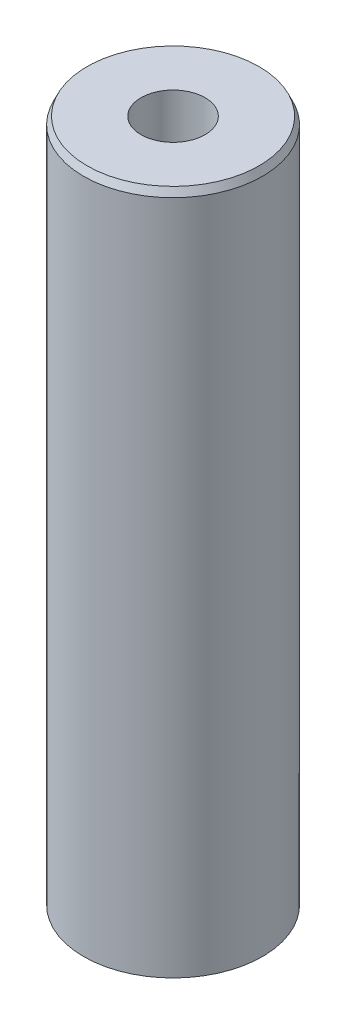
ISO-10303-21;
HEADER;
FILE_DESCRIPTION(('STEP AP214'),'2;1');
FILE_NAME('part.step','',(''),(''),'','','');
FILE_SCHEMA(('AUTOMOTIVE_DESIGN { 1 0 10303 214 1 1 1 1 }'));
ENDSEC;
DATA;
#1=APPLICATION_CONTEXT('core data for automotive mechanical design processes');
#2=APPLICATION_PROTOCOL_DEFINITION('international standard','automotive_design',2000,#1);
#3=PRODUCT_CONTEXT('',#1,'mechanical');
#4=PRODUCT('Part','Part','',(#3));
#5=PRODUCT_RELATED_PRODUCT_CATEGORY('part','',(#4));
#6=PRODUCT_DEFINITION_FORMATION('','',#4);
#7=PRODUCT_DEFINITION_CONTEXT('part definition',#1,'design');
#8=PRODUCT_DEFINITION('design','',#6,#7);
#9=PRODUCT_DEFINITION_SHAPE('','',#8);
#10=(LENGTH_UNIT() NAMED_UNIT(*) SI_UNIT(.MILLI.,.METRE.));
#11=(NAMED_UNIT(*) PLANE_ANGLE_UNIT() SI_UNIT($,.RADIAN.));
#12=(NAMED_UNIT(*) SI_UNIT($,.STERADIAN.) SOLID_ANGLE_UNIT());
#13=UNCERTAINTY_MEASURE_WITH_UNIT(LENGTH_MEASURE(1.E-05),#10,'distance_accuracy_value','');
#14=(GEOMETRIC_REPRESENTATION_CONTEXT(3) GLOBAL_UNCERTAINTY_ASSIGNED_CONTEXT((#13)) GLOBAL_UNIT_ASSIGNED_CONTEXT((#10,
#11,#12)) REPRESENTATION_CONTEXT('',''));
#15=CARTESIAN_POINT('',(0.,0.,0.));
#16=DIRECTION('',(0.,0.,1.));
#17=DIRECTION('',(1.,0.,0.));
#18=AXIS2_PLACEMENT_3D('',#15,#16,#17);
#19=CARTESIAN_POINT('',(0.,441.389600119496,0.));
#20=DIRECTION('',(0.,-1.,0.));
#21=DIRECTION('',(0.,0.,-1.));
#22=AXIS2_PLACEMENT_3D('',#19,#20,#21);
#23=CYLINDRICAL_SURFACE('',#22,57.5);
#24=CARTESIAN_POINT('',(0.,436.647566409493,0.));
#25=DIRECTION('',(0.,1.,0.));
#26=DIRECTION('',(0.,0.,1.));
#27=AXIS2_PLACEMENT_3D('',#24,#25,#26);
#28=CIRCLE('',#27,57.5);
#29=CARTESIAN_POINT('',(0.,436.647566409493,57.5));
#30=VERTEX_POINT('',#29);
#31=EDGE_CURVE('E50',#30,#30,#28,.F.);
#32=ORIENTED_EDGE('',*,*,#31,.T.);
#33=EDGE_LOOP('',(#32));
#34=FACE_BOUND('',#33,.T.);
#35=CARTESIAN_POINT('',(0.,2.21265047644015,0.));
#36=DIRECTION('',(0.,1.,0.));
#37=DIRECTION('',(0.,0.,1.));
#38=AXIS2_PLACEMENT_3D('',#35,#36,#37);
#39=CIRCLE('',#38,57.5);
#40=CARTESIAN_POINT('',(0.,2.21265047644015,57.5));
#41=VERTEX_POINT('',#40);
#42=EDGE_CURVE('E51',#41,#41,#39,.T.);
#43=ORIENTED_EDGE('',*,*,#42,.T.);
#44=EDGE_LOOP('',(#43));
#45=FACE_BOUND('',#44,.T.);
#46=ADVANCED_FACE('F39',(#34,#45),#23,.T.);
#47=CARTESIAN_POINT('',(0.,441.389600119496,0.));
#48=DIRECTION('',(0.,1.,0.));
#49=DIRECTION('',(0.,0.,1.));
#50=AXIS2_PLACEMENT_3D('',#47,#48,#49);
#51=PLANE('',#50);
#52=CARTESIAN_POINT('',(0.,441.389600119496,0.));
#53=DIRECTION('',(0.,1.,0.));
#54=DIRECTION('',(0.,0.,1.));
#55=AXIS2_PLACEMENT_3D('',#52,#53,#54);
#56=CIRCLE('',#55,55.2873495235598);
#57=CARTESIAN_POINT('',(0.,441.389600119496,55.2873495235598));
#58=VERTEX_POINT('',#57);
#59=EDGE_CURVE('E54',#58,#58,#56,.T.);
#60=ORIENTED_EDGE('',*,*,#59,.T.);
#61=EDGE_LOOP('',(#60));
#62=FACE_BOUND('',#61,.T.);
#63=CARTESIAN_POINT('',(0.,441.389600119496,0.));
#64=DIRECTION('',(0.,1.,0.));
#65=DIRECTION('',(0.,0.,1.));
#66=AXIS2_PLACEMENT_3D('',#63,#64,#65);
#67=CIRCLE('',#66,20.6155559577213);
#68=CARTESIAN_POINT('',(0.,441.389600119496,20.6155559577213));
#69=VERTEX_POINT('',#68);
#70=EDGE_CURVE('E58',#69,#69,#67,.T.);
#71=ORIENTED_EDGE('',*,*,#70,.F.);
#72=EDGE_LOOP('',(#71));
#73=FACE_BOUND('',#72,.T.);
#74=ADVANCED_FACE('F69',(#62,#73),#51,.T.);
#75=CARTESIAN_POINT('',(0.,0.,0.));
#76=DIRECTION('',(0.,1.,0.));
#77=DIRECTION('',(0.,0.,1.));
#78=AXIS2_PLACEMENT_3D('',#75,#76,#77);
#79=PLANE('',#78);
#80=CARTESIAN_POINT('',(0.,0.,0.));
#81=DIRECTION('',(0.,1.,0.));
#82=DIRECTION('',(0.,0.,1.));
#83=AXIS2_PLACEMENT_3D('',#80,#81,#82);
#84=CIRCLE('',#83,52.757966289997);
#85=CARTESIAN_POINT('',(0.,0.,52.757966289997));
#86=VERTEX_POINT('',#85);
#87=EDGE_CURVE('E10',#86,#86,#84,.F.);
#88=ORIENTED_EDGE('',*,*,#87,.T.);
#89=EDGE_LOOP('',(#88));
#90=FACE_BOUND('',#89,.T.);
#91=CARTESIAN_POINT('',(0.,0.,0.));
#92=DIRECTION('',(0.,1.,0.));
#93=DIRECTION('',(0.,0.,1.));
#94=AXIS2_PLACEMENT_3D('',#91,#92,#93);
#95=CIRCLE('',#94,20.6155559577213);
#96=CARTESIAN_POINT('',(0.,0.,20.6155559577213));
#97=VERTEX_POINT('',#96);
#98=EDGE_CURVE('E63',#97,#97,#95,.T.);
#99=ORIENTED_EDGE('',*,*,#98,.T.);
#100=EDGE_LOOP('',(#99));
#101=FACE_BOUND('',#100,.T.);
#102=ADVANCED_FACE('F75',(#90,#101),#79,.F.);
#103=CARTESIAN_POINT('',(0.,441.389600119496,0.));
#104=DIRECTION('',(0.,-1.,0.));
#105=DIRECTION('',(0.,0.,-1.));
#106=AXIS2_PLACEMENT_3D('',#103,#104,#105);
#107=CYLINDRICAL_SURFACE('',#106,20.6155559577213);
#108=ORIENTED_EDGE('',*,*,#70,.T.);
#109=EDGE_LOOP('',(#108));
#110=FACE_BOUND('',#109,.T.);
#111=ORIENTED_EDGE('',*,*,#98,.F.);
#112=EDGE_LOOP('',(#111));
#113=FACE_BOUND('',#112,.T.);
#114=ADVANCED_FACE('F70',(#110,#113),#107,.F.);
#115=CARTESIAN_POINT('',(0.,441.389600119496,0.));
#116=DIRECTION('',(0.,-1.,0.));
#117=DIRECTION('',(0.,0.,-1.));
#118=AXIS2_PLACEMENT_3D('',#115,#116,#117);
#119=CONICAL_SURFACE('',#118,55.2873495235598,0.436575452678117);
#120=ORIENTED_EDGE('',*,*,#31,.F.);
#121=EDGE_LOOP('',(#120));
#122=FACE_BOUND('',#121,.T.);
#123=ORIENTED_EDGE('',*,*,#59,.F.);
#124=EDGE_LOOP('',(#123));
#125=FACE_BOUND('',#124,.T.);
#126=ADVANCED_FACE('F81',(#122,#125),#119,.T.);
#127=CARTESIAN_POINT('',(0.,2.21265047644015,0.));
#128=DIRECTION('',(0.,1.,0.));
#129=DIRECTION('',(0.,0.,1.));
#130=AXIS2_PLACEMENT_3D('',#127,#128,#129);
#131=CONICAL_SURFACE('',#130,57.5,1.1342208741168);
#132=ORIENTED_EDGE('',*,*,#87,.F.);
#133=EDGE_LOOP('',(#132));
#134=FACE_BOUND('',#133,.T.);
#135=ORIENTED_EDGE('',*,*,#42,.F.);
#136=EDGE_LOOP('',(#135));
#137=FACE_BOUND('',#136,.T.);
#138=ADVANCED_FACE('F45',(#134,#137),#131,.T.);
#139=CLOSED_SHELL('',(#46,#74,#102,#114,#126,#138));
#140=MANIFOLD_SOLID_BREP('B2',#139);
#141=ADVANCED_BREP_SHAPE_REPRESENTATION('',(#18,#140),#14);
#142=SHAPE_DEFINITION_REPRESENTATION(#9,#141);
ENDSEC;
END-ISO-10303-21;
